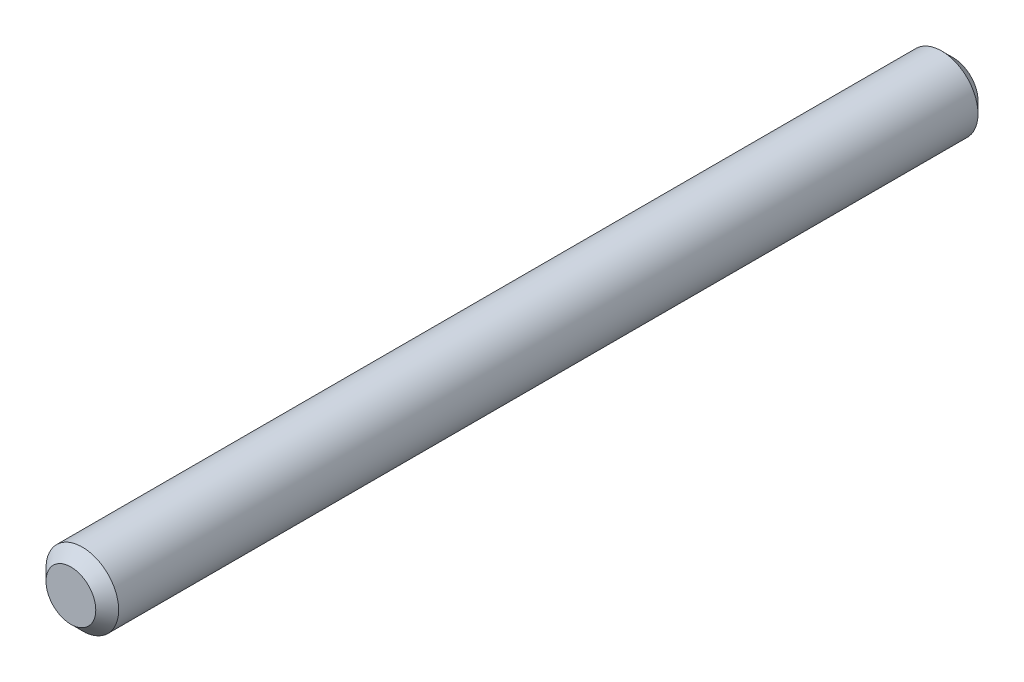
ISO-10303-21;
HEADER;
FILE_DESCRIPTION(('STEP AP214'),'2;1');
FILE_NAME('part.step','',(''),(''),'','','');
FILE_SCHEMA(('AUTOMOTIVE_DESIGN { 1 0 10303 214 1 1 1 1 }'));
ENDSEC;
DATA;
#1=APPLICATION_CONTEXT('core data for automotive mechanical design processes');
#2=APPLICATION_PROTOCOL_DEFINITION('international standard','automotive_design',2000,#1);
#3=PRODUCT_CONTEXT('',#1,'mechanical');
#4=PRODUCT('Part','Part','',(#3));
#5=PRODUCT_RELATED_PRODUCT_CATEGORY('part','',(#4));
#6=PRODUCT_DEFINITION_FORMATION('','',#4);
#7=PRODUCT_DEFINITION_CONTEXT('part definition',#1,'design');
#8=PRODUCT_DEFINITION('design','',#6,#7);
#9=PRODUCT_DEFINITION_SHAPE('','',#8);
#10=(LENGTH_UNIT() NAMED_UNIT(*) SI_UNIT(.MILLI.,.METRE.));
#11=(NAMED_UNIT(*) PLANE_ANGLE_UNIT() SI_UNIT($,.RADIAN.));
#12=(NAMED_UNIT(*) SI_UNIT($,.STERADIAN.) SOLID_ANGLE_UNIT());
#13=UNCERTAINTY_MEASURE_WITH_UNIT(LENGTH_MEASURE(1.E-05),#10,'distance_accuracy_value','');
#14=(GEOMETRIC_REPRESENTATION_CONTEXT(3) GLOBAL_UNCERTAINTY_ASSIGNED_CONTEXT((#13)) GLOBAL_UNIT_ASSIGNED_CONTEXT((#10,
#11,#12)) REPRESENTATION_CONTEXT('',''));
#15=CARTESIAN_POINT('',(0.,0.,0.));
#16=DIRECTION('',(0.,0.,1.));
#17=DIRECTION('',(1.,0.,0.));
#18=AXIS2_PLACEMENT_3D('',#15,#16,#17);
#19=CARTESIAN_POINT('',(0.,0.,-77.086000006));
#20=DIRECTION('',(0.,0.,1.));
#21=DIRECTION('',(1.,0.,0.));
#22=AXIS2_PLACEMENT_3D('',#19,#20,#21);
#23=CYLINDRICAL_SURFACE('',#22,3.175);
#24=CARTESIAN_POINT('',(0.,0.,-76.086000006));
#25=DIRECTION('',(0.,0.,1.));
#26=DIRECTION('',(1.,0.,0.));
#27=AXIS2_PLACEMENT_3D('',#24,#25,#26);
#28=CIRCLE('',#27,3.175);
#29=CARTESIAN_POINT('',(3.17500000000001,0.,-76.086000006));
#30=VERTEX_POINT('',#29);
#31=EDGE_CURVE('E59',#30,#30,#28,.T.);
#32=ORIENTED_EDGE('',*,*,#31,.T.);
#33=EDGE_LOOP('',(#32));
#34=FACE_BOUND('',#33,.T.);
#35=CARTESIAN_POINT('',(0.,0.,-1.));
#36=DIRECTION('',(0.,0.,1.));
#37=DIRECTION('',(1.,0.,0.));
#38=AXIS2_PLACEMENT_3D('',#35,#36,#37);
#39=CIRCLE('',#38,3.175);
#40=CARTESIAN_POINT('',(3.17500000000001,0.,-1.));
#41=VERTEX_POINT('',#40);
#42=EDGE_CURVE('E63',#41,#41,#39,.F.);
#43=ORIENTED_EDGE('',*,*,#42,.T.);
#44=EDGE_LOOP('',(#43));
#45=FACE_BOUND('',#44,.T.);
#46=ADVANCED_FACE('F48',(#34,#45),#23,.T.);
#47=CARTESIAN_POINT('',(0.,0.,-77.086000006));
#48=DIRECTION('',(0.,0.,1.));
#49=DIRECTION('',(1.,0.,0.));
#50=AXIS2_PLACEMENT_3D('',#47,#48,#49);
#51=PLANE('',#50);
#52=CARTESIAN_POINT('',(0.,0.,-77.086000006));
#53=DIRECTION('',(0.,0.,1.));
#54=DIRECTION('',(1.,0.,0.));
#55=AXIS2_PLACEMENT_3D('',#52,#53,#54);
#56=CIRCLE('',#55,2.17499999999998);
#57=CARTESIAN_POINT('',(2.17499999999999,0.,-77.086000006));
#58=VERTEX_POINT('',#57);
#59=EDGE_CURVE('E55',#58,#58,#56,.F.);
#60=ORIENTED_EDGE('',*,*,#59,.T.);
#61=EDGE_LOOP('',(#60));
#62=FACE_BOUND('',#61,.T.);
#63=ADVANCED_FACE('F79',(#62),#51,.F.);
#64=CARTESIAN_POINT('',(0.,0.,0.));
#65=DIRECTION('',(0.,0.,1.));
#66=DIRECTION('',(1.,0.,0.));
#67=AXIS2_PLACEMENT_3D('',#64,#65,#66);
#68=PLANE('',#67);
#69=CARTESIAN_POINT('',(0.,0.,0.));
#70=DIRECTION('',(0.,0.,1.));
#71=DIRECTION('',(1.,0.,0.));
#72=AXIS2_PLACEMENT_3D('',#69,#70,#71);
#73=CIRCLE('',#72,2.175);
#74=CARTESIAN_POINT('',(2.17500000000001,0.,0.));
#75=VERTEX_POINT('',#74);
#76=EDGE_CURVE('E12',#75,#75,#73,.T.);
#77=ORIENTED_EDGE('',*,*,#76,.T.);
#78=EDGE_LOOP('',(#77));
#79=FACE_BOUND('',#78,.T.);
#80=ADVANCED_FACE('F76',(#79),#68,.T.);
#81=CARTESIAN_POINT('',(0.,0.,-76.086000006));
#82=DIRECTION('',(0.,0.,1.));
#83=DIRECTION('',(1.,0.,0.));
#84=AXIS2_PLACEMENT_3D('',#81,#82,#83);
#85=CONICAL_SURFACE('',#84,3.175,0.78539816339745);
#86=ORIENTED_EDGE('',*,*,#59,.F.);
#87=EDGE_LOOP('',(#86));
#88=FACE_BOUND('',#87,.T.);
#89=ORIENTED_EDGE('',*,*,#31,.F.);
#90=EDGE_LOOP('',(#89));
#91=FACE_BOUND('',#90,.T.);
#92=ADVANCED_FACE('F72',(#88,#91),#85,.T.);
#93=CARTESIAN_POINT('',(0.,0.,0.));
#94=DIRECTION('',(0.,0.,-1.));
#95=DIRECTION('',(-1.,0.,0.));
#96=AXIS2_PLACEMENT_3D('',#93,#94,#95);
#97=CONICAL_SURFACE('',#96,2.175,0.785398163397446);
#98=ORIENTED_EDGE('',*,*,#42,.F.);
#99=EDGE_LOOP('',(#98));
#100=FACE_BOUND('',#99,.T.);
#101=ORIENTED_EDGE('',*,*,#76,.F.);
#102=EDGE_LOOP('',(#101));
#103=FACE_BOUND('',#102,.T.);
#104=ADVANCED_FACE('F50',(#100,#103),#97,.T.);
#105=CLOSED_SHELL('',(#46,#63,#80,#92,#104));
#106=MANIFOLD_SOLID_BREP('B2',#105);
#107=ADVANCED_BREP_SHAPE_REPRESENTATION('',(#18,#106),#14);
#108=SHAPE_DEFINITION_REPRESENTATION(#9,#107);
ENDSEC;
END-ISO-10303-21;
